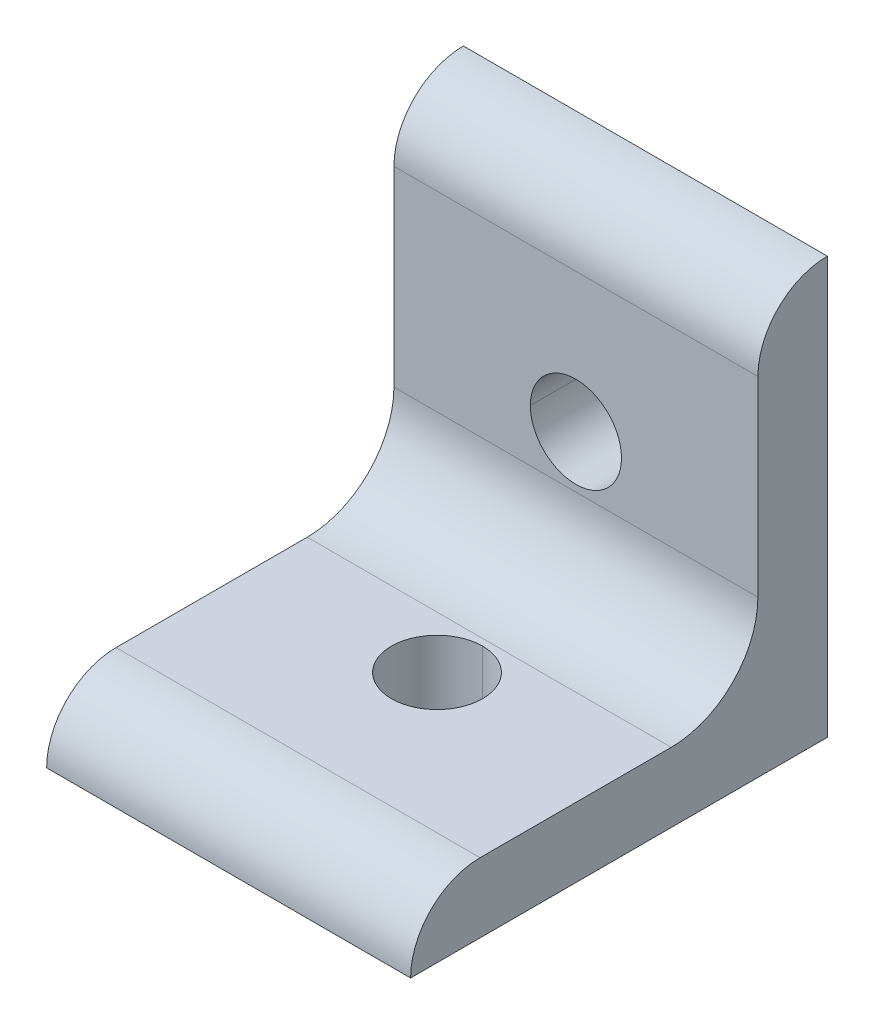
ISO-10303-21;
HEADER;
FILE_DESCRIPTION(('STEP AP214'),'2;1');
FILE_NAME('part.step','',(''),(''),'','','');
FILE_SCHEMA(('AUTOMOTIVE_DESIGN { 1 0 10303 214 1 1 1 1 }'));
ENDSEC;
DATA;
#1=APPLICATION_CONTEXT('core data for automotive mechanical design processes');
#2=APPLICATION_PROTOCOL_DEFINITION('international standard','automotive_design',2000,#1);
#3=PRODUCT_CONTEXT('',#1,'mechanical');
#4=PRODUCT('Part','Part','',(#3));
#5=PRODUCT_RELATED_PRODUCT_CATEGORY('part','',(#4));
#6=PRODUCT_DEFINITION_FORMATION('','',#4);
#7=PRODUCT_DEFINITION_CONTEXT('part definition',#1,'design');
#8=PRODUCT_DEFINITION('design','',#6,#7);
#9=PRODUCT_DEFINITION_SHAPE('','',#8);
#10=(LENGTH_UNIT() NAMED_UNIT(*) SI_UNIT(.MILLI.,.METRE.));
#11=(NAMED_UNIT(*) PLANE_ANGLE_UNIT() SI_UNIT($,.RADIAN.));
#12=(NAMED_UNIT(*) SI_UNIT($,.STERADIAN.) SOLID_ANGLE_UNIT());
#13=UNCERTAINTY_MEASURE_WITH_UNIT(LENGTH_MEASURE(1.E-05),#10,'distance_accuracy_value','');
#14=(GEOMETRIC_REPRESENTATION_CONTEXT(3) GLOBAL_UNCERTAINTY_ASSIGNED_CONTEXT((#13)) GLOBAL_UNIT_ASSIGNED_CONTEXT((#10,
#11,#12)) REPRESENTATION_CONTEXT('',''));
#15=CARTESIAN_POINT('',(0.,0.,0.));
#16=DIRECTION('',(0.,0.,1.));
#17=DIRECTION('',(1.,0.,0.));
#18=AXIS2_PLACEMENT_3D('',#15,#16,#17);
#19=CARTESIAN_POINT('',(16.637,-1.46063716677247E-12,31.7499999999986));
#20=DIRECTION('',(-1.,0.,0.));
#21=DIRECTION('',(0.,-0.707106781186548,-0.707106781186547));
#22=AXIS2_PLACEMENT_3D('',#19,#20,#21);
#23=CYLINDRICAL_SURFACE('',#22,6.35000000000146);
#24=CARTESIAN_POINT('',(-16.637,-1.46063716677247E-12,31.7499999999986));
#25=DIRECTION('',(1.,0.,0.));
#26=DIRECTION('',(0.,0.,-1.));
#27=AXIS2_PLACEMENT_3D('',#24,#25,#26);
#28=CIRCLE('',#27,6.35000000000146);
#29=CARTESIAN_POINT('',(-16.637,6.35,31.75));
#30=VERTEX_POINT('',#29);
#31=CARTESIAN_POINT('',(-16.637,0.,38.1));
#32=VERTEX_POINT('',#31);
#33=EDGE_CURVE('E11',#30,#32,#28,.T.);
#34=ORIENTED_EDGE('',*,*,#33,.T.);
#35=DIRECTION('',(-1.,0.,0.));
#36=VECTOR('',#35,1.);
#37=CARTESIAN_POINT('',(16.637,0.,38.1));
#38=LINE('',#37,#36);
#39=CARTESIAN_POINT('',(16.637,0.,38.1));
#40=VERTEX_POINT('',#39);
#41=EDGE_CURVE('E25',#40,#32,#38,.T.);
#42=ORIENTED_EDGE('',*,*,#41,.F.);
#43=CARTESIAN_POINT('',(16.637,-1.46063716677247E-12,31.7499999999986));
#44=DIRECTION('',(1.,0.,0.));
#45=DIRECTION('',(0.,0.,-1.));
#46=AXIS2_PLACEMENT_3D('',#43,#44,#45);
#47=CIRCLE('',#46,6.35000000000146);
#48=CARTESIAN_POINT('',(16.637,6.35,31.75));
#49=VERTEX_POINT('',#48);
#50=EDGE_CURVE('E238',#49,#40,#47,.T.);
#51=ORIENTED_EDGE('',*,*,#50,.F.);
#52=DIRECTION('',(-1.,0.,0.));
#53=VECTOR('',#52,1.);
#54=CARTESIAN_POINT('',(16.637,6.35,31.75));
#55=LINE('',#54,#53);
#56=EDGE_CURVE('E234',#49,#30,#55,.T.);
#57=ORIENTED_EDGE('',*,*,#56,.T.);
#58=EDGE_LOOP('',(#34,#42,#51,#57));
#59=FACE_BOUND('',#58,.T.);
#60=ADVANCED_FACE('F17',(#59),#23,.T.);
#61=CARTESIAN_POINT('',(16.637,6.35,14.2748));
#62=DIRECTION('',(0.,-1.,0.));
#63=DIRECTION('',(0.,0.,-1.));
#64=AXIS2_PLACEMENT_3D('',#61,#62,#63);
#65=PLANE('',#64);
#66=CARTESIAN_POINT('',(0.,6.35,19.05));
#67=DIRECTION('',(0.,1.,0.));
#68=DIRECTION('',(1.,0.,0.));
#69=AXIS2_PLACEMENT_3D('',#66,#67,#68);
#70=CIRCLE('',#69,4.1656);
#71=CARTESIAN_POINT('',(0.,6.35,14.8844));
#72=VERTEX_POINT('',#71);
#73=CARTESIAN_POINT('',(0.,6.35,23.2156));
#74=VERTEX_POINT('',#73);
#75=EDGE_CURVE('E230',#72,#74,#70,.T.);
#76=ORIENTED_EDGE('',*,*,#75,.F.);
#77=CARTESIAN_POINT('',(0.,6.35,19.05));
#78=DIRECTION('',(0.,1.,0.));
#79=DIRECTION('',(0.,0.,1.));
#80=AXIS2_PLACEMENT_3D('',#77,#78,#79);
#81=CIRCLE('',#80,4.1656);
#82=EDGE_CURVE('E116',#74,#72,#81,.T.);
#83=ORIENTED_EDGE('',*,*,#82,.F.);
#84=EDGE_LOOP('',(#76,#83));
#85=FACE_BOUND('',#84,.T.);
#86=DIRECTION('',(0.,0.,1.));
#87=VECTOR('',#86,1.);
#88=CARTESIAN_POINT('',(-16.637,6.35,14.2748));
#89=LINE('',#88,#87);
#90=CARTESIAN_POINT('',(-16.637,6.35,14.2748));
#91=VERTEX_POINT('',#90);
#92=EDGE_CURVE('E222',#91,#30,#89,.T.);
#93=ORIENTED_EDGE('',*,*,#92,.T.);
#94=ORIENTED_EDGE('',*,*,#56,.F.);
#95=DIRECTION('',(0.,0.,1.));
#96=VECTOR('',#95,1.);
#97=CARTESIAN_POINT('',(16.637,6.35,14.2748));
#98=LINE('',#97,#96);
#99=CARTESIAN_POINT('',(16.637,6.35,14.2748));
#100=VERTEX_POINT('',#99);
#101=EDGE_CURVE('E217',#100,#49,#98,.T.);
#102=ORIENTED_EDGE('',*,*,#101,.F.);
#103=DIRECTION('',(-1.,0.,0.));
#104=VECTOR('',#103,1.);
#105=CARTESIAN_POINT('',(16.637,6.35,14.2748));
#106=LINE('',#105,#104);
#107=EDGE_CURVE('E213',#100,#91,#106,.T.);
#108=ORIENTED_EDGE('',*,*,#107,.T.);
#109=EDGE_LOOP('',(#93,#94,#102,#108));
#110=FACE_BOUND('',#109,.T.);
#111=ADVANCED_FACE('F255',(#85,#110),#65,.F.);
#112=CARTESIAN_POINT('',(16.637,14.2748000000002,14.2748000000002));
#113=DIRECTION('',(-1.,0.,0.));
#114=DIRECTION('',(0.,0.707106781186537,0.707106781186558));
#115=AXIS2_PLACEMENT_3D('',#112,#113,#114);
#116=CYLINDRICAL_SURFACE('',#115,7.92480000000024);
#117=CARTESIAN_POINT('',(-16.637,14.2748000000002,14.2748000000002));
#118=DIRECTION('',(1.,0.,0.));
#119=DIRECTION('',(0.,0.,-1.));
#120=AXIS2_PLACEMENT_3D('',#117,#118,#119);
#121=CIRCLE('',#120,7.92480000000024);
#122=CARTESIAN_POINT('',(-16.637,14.2748,6.35));
#123=VERTEX_POINT('',#122);
#124=EDGE_CURVE('E208',#91,#123,#121,.T.);
#125=ORIENTED_EDGE('',*,*,#124,.F.);
#126=ORIENTED_EDGE('',*,*,#107,.F.);
#127=CARTESIAN_POINT('',(16.637,14.2748000000002,14.2748000000002));
#128=DIRECTION('',(1.,0.,0.));
#129=DIRECTION('',(0.,0.,-1.));
#130=AXIS2_PLACEMENT_3D('',#127,#128,#129);
#131=CIRCLE('',#130,7.92480000000024);
#132=CARTESIAN_POINT('',(16.637,14.2748,6.35));
#133=VERTEX_POINT('',#132);
#134=EDGE_CURVE('E204',#100,#133,#131,.T.);
#135=ORIENTED_EDGE('',*,*,#134,.T.);
#136=DIRECTION('',(-1.,0.,0.));
#137=VECTOR('',#136,1.);
#138=CARTESIAN_POINT('',(16.637,14.2748,6.35));
#139=LINE('',#138,#137);
#140=EDGE_CURVE('E200',#133,#123,#139,.T.);
#141=ORIENTED_EDGE('',*,*,#140,.T.);
#142=EDGE_LOOP('',(#125,#126,#135,#141));
#143=FACE_BOUND('',#142,.T.);
#144=ADVANCED_FACE('F272',(#143),#116,.F.);
#145=CARTESIAN_POINT('',(16.637,31.75,6.35));
#146=DIRECTION('',(0.,0.,-1.));
#147=DIRECTION('',(-1.,0.,0.));
#148=AXIS2_PLACEMENT_3D('',#145,#146,#147);
#149=PLANE('',#148);
#150=CARTESIAN_POINT('',(0.,19.05,6.35));
#151=DIRECTION('',(0.,0.,1.));
#152=DIRECTION('',(1.,0.,0.));
#153=AXIS2_PLACEMENT_3D('',#150,#151,#152);
#154=CIRCLE('',#153,4.1656);
#155=CARTESIAN_POINT('',(-4.1656,19.05,6.35));
#156=VERTEX_POINT('',#155);
#157=CARTESIAN_POINT('',(4.1656,19.05,6.35));
#158=VERTEX_POINT('',#157);
#159=EDGE_CURVE('E195',#156,#158,#154,.T.);
#160=ORIENTED_EDGE('',*,*,#159,.F.);
#161=CARTESIAN_POINT('',(0.,19.05,6.35));
#162=DIRECTION('',(0.,0.,1.));
#163=DIRECTION('',(1.,0.,0.));
#164=AXIS2_PLACEMENT_3D('',#161,#162,#163);
#165=CIRCLE('',#164,4.1656);
#166=EDGE_CURVE('E190',#158,#156,#165,.T.);
#167=ORIENTED_EDGE('',*,*,#166,.F.);
#168=EDGE_LOOP('',(#160,#167));
#169=FACE_BOUND('',#168,.T.);
#170=DIRECTION('',(0.,-1.,0.));
#171=VECTOR('',#170,1.);
#172=CARTESIAN_POINT('',(-16.637,31.75,6.35));
#173=LINE('',#172,#171);
#174=CARTESIAN_POINT('',(-16.637,31.75,6.35));
#175=VERTEX_POINT('',#174);
#176=EDGE_CURVE('E185',#175,#123,#173,.T.);
#177=ORIENTED_EDGE('',*,*,#176,.T.);
#178=ORIENTED_EDGE('',*,*,#140,.F.);
#179=DIRECTION('',(0.,-1.,0.));
#180=VECTOR('',#179,1.);
#181=CARTESIAN_POINT('',(16.637,31.75,6.35));
#182=LINE('',#181,#180);
#183=CARTESIAN_POINT('',(16.637,31.75,6.35));
#184=VERTEX_POINT('',#183);
#185=EDGE_CURVE('E180',#184,#133,#182,.T.);
#186=ORIENTED_EDGE('',*,*,#185,.F.);
#187=DIRECTION('',(-1.,0.,0.));
#188=VECTOR('',#187,1.);
#189=CARTESIAN_POINT('',(16.637,31.75,6.35));
#190=LINE('',#189,#188);
#191=EDGE_CURVE('E176',#184,#175,#190,.T.);
#192=ORIENTED_EDGE('',*,*,#191,.T.);
#193=EDGE_LOOP('',(#177,#178,#186,#192));
#194=FACE_BOUND('',#193,.T.);
#195=ADVANCED_FACE('F270',(#169,#194),#149,.F.);
#196=CARTESIAN_POINT('',(16.637,31.7499999999986,-1.46020348590348E-12));
#197=DIRECTION('',(-1.,0.,0.));
#198=DIRECTION('',(0.,-0.707106781186547,-0.707106781186548));
#199=AXIS2_PLACEMENT_3D('',#196,#197,#198);
#200=CYLINDRICAL_SURFACE('',#199,6.35000000000146);
#201=CARTESIAN_POINT('',(-16.637,31.7499999999986,-1.46020348590348E-12));
#202=DIRECTION('',(1.,0.,0.));
#203=DIRECTION('',(0.,0.,-1.));
#204=AXIS2_PLACEMENT_3D('',#201,#202,#203);
#205=CIRCLE('',#204,6.35000000000146);
#206=CARTESIAN_POINT('',(-16.637,38.1,0.));
#207=VERTEX_POINT('',#206);
#208=EDGE_CURVE('E171',#207,#175,#205,.T.);
#209=ORIENTED_EDGE('',*,*,#208,.T.);
#210=ORIENTED_EDGE('',*,*,#191,.F.);
#211=CARTESIAN_POINT('',(16.637,31.7499999999986,-1.46020348590348E-12));
#212=DIRECTION('',(1.,0.,0.));
#213=DIRECTION('',(0.,0.,-1.));
#214=AXIS2_PLACEMENT_3D('',#211,#212,#213);
#215=CIRCLE('',#214,6.35000000000146);
#216=CARTESIAN_POINT('',(16.637,38.1,0.));
#217=VERTEX_POINT('',#216);
#218=EDGE_CURVE('E166',#217,#184,#215,.T.);
#219=ORIENTED_EDGE('',*,*,#218,.F.);
#220=DIRECTION('',(-1.,0.,0.));
#221=VECTOR('',#220,1.);
#222=CARTESIAN_POINT('',(16.637,38.1,0.));
#223=LINE('',#222,#221);
#224=EDGE_CURVE('E162',#217,#207,#223,.T.);
#225=ORIENTED_EDGE('',*,*,#224,.T.);
#226=EDGE_LOOP('',(#209,#210,#219,#225));
#227=FACE_BOUND('',#226,.T.);
#228=ADVANCED_FACE('F268',(#227),#200,.T.);
#229=CARTESIAN_POINT('',(16.637,0.,0.));
#230=DIRECTION('',(0.,0.,1.));
#231=DIRECTION('',(1.,0.,0.));
#232=AXIS2_PLACEMENT_3D('',#229,#230,#231);
#233=PLANE('',#232);
#234=CARTESIAN_POINT('',(0.,19.05,0.));
#235=DIRECTION('',(0.,0.,1.));
#236=DIRECTION('',(1.,0.,0.));
#237=AXIS2_PLACEMENT_3D('',#234,#235,#236);
#238=CIRCLE('',#237,4.1656);
#239=CARTESIAN_POINT('',(4.1656,19.05,0.));
#240=VERTEX_POINT('',#239);
#241=CARTESIAN_POINT('',(-4.1656,19.05,0.));
#242=VERTEX_POINT('',#241);
#243=EDGE_CURVE('E158',#240,#242,#238,.T.);
#244=ORIENTED_EDGE('',*,*,#243,.T.);
#245=CARTESIAN_POINT('',(0.,19.05,0.));
#246=DIRECTION('',(0.,0.,1.));
#247=DIRECTION('',(1.,0.,0.));
#248=AXIS2_PLACEMENT_3D('',#245,#246,#247);
#249=CIRCLE('',#248,4.1656);
#250=EDGE_CURVE('E154',#242,#240,#249,.T.);
#251=ORIENTED_EDGE('',*,*,#250,.T.);
#252=EDGE_LOOP('',(#244,#251));
#253=FACE_BOUND('',#252,.T.);
#254=DIRECTION('',(0.,1.,0.));
#255=VECTOR('',#254,1.);
#256=CARTESIAN_POINT('',(-16.637,0.,0.));
#257=LINE('',#256,#255);
#258=CARTESIAN_POINT('',(-16.637,0.,0.));
#259=VERTEX_POINT('',#258);
#260=EDGE_CURVE('E149',#259,#207,#257,.T.);
#261=ORIENTED_EDGE('',*,*,#260,.T.);
#262=ORIENTED_EDGE('',*,*,#224,.F.);
#263=DIRECTION('',(0.,1.,0.));
#264=VECTOR('',#263,1.);
#265=CARTESIAN_POINT('',(16.637,0.,0.));
#266=LINE('',#265,#264);
#267=CARTESIAN_POINT('',(16.637,0.,0.));
#268=VERTEX_POINT('',#267);
#269=EDGE_CURVE('E144',#268,#217,#266,.T.);
#270=ORIENTED_EDGE('',*,*,#269,.F.);
#271=DIRECTION('',(-1.,0.,0.));
#272=VECTOR('',#271,1.);
#273=CARTESIAN_POINT('',(16.637,0.,0.));
#274=LINE('',#273,#272);
#275=EDGE_CURVE('E113',#268,#259,#274,.T.);
#276=ORIENTED_EDGE('',*,*,#275,.T.);
#277=EDGE_LOOP('',(#261,#262,#270,#276));
#278=FACE_BOUND('',#277,.T.);
#279=ADVANCED_FACE('F264',(#253,#278),#233,.F.);
#280=CARTESIAN_POINT('',(16.637,0.,38.1));
#281=DIRECTION('',(0.,1.,0.));
#282=DIRECTION('',(0.,0.,1.));
#283=AXIS2_PLACEMENT_3D('',#280,#281,#282);
#284=PLANE('',#283);
#285=CARTESIAN_POINT('',(0.,0.,19.05));
#286=DIRECTION('',(0.,1.,0.));
#287=DIRECTION('',(1.,0.,0.));
#288=AXIS2_PLACEMENT_3D('',#285,#286,#287);
#289=CIRCLE('',#288,4.1656);
#290=CARTESIAN_POINT('',(0.,0.,14.8844));
#291=VERTEX_POINT('',#290);
#292=CARTESIAN_POINT('',(0.,0.,23.2156));
#293=VERTEX_POINT('',#292);
#294=EDGE_CURVE('E99',#291,#293,#289,.T.);
#295=ORIENTED_EDGE('',*,*,#294,.T.);
#296=CARTESIAN_POINT('',(0.,0.,19.05));
#297=DIRECTION('',(0.,1.,0.));
#298=DIRECTION('',(0.,0.,1.));
#299=AXIS2_PLACEMENT_3D('',#296,#297,#298);
#300=CIRCLE('',#299,4.1656);
#301=EDGE_CURVE('E95',#293,#291,#300,.T.);
#302=ORIENTED_EDGE('',*,*,#301,.T.);
#303=EDGE_LOOP('',(#295,#302));
#304=FACE_BOUND('',#303,.T.);
#305=DIRECTION('',(0.,0.,-1.));
#306=VECTOR('',#305,1.);
#307=CARTESIAN_POINT('',(-16.637,0.,38.1));
#308=LINE('',#307,#306);
#309=EDGE_CURVE('E104',#32,#259,#308,.T.);
#310=ORIENTED_EDGE('',*,*,#309,.T.);
#311=ORIENTED_EDGE('',*,*,#275,.F.);
#312=DIRECTION('',(0.,0.,-1.));
#313=VECTOR('',#312,1.);
#314=CARTESIAN_POINT('',(16.637,0.,38.1));
#315=LINE('',#314,#313);
#316=EDGE_CURVE('E119',#40,#268,#315,.T.);
#317=ORIENTED_EDGE('',*,*,#316,.F.);
#318=ORIENTED_EDGE('',*,*,#41,.T.);
#319=EDGE_LOOP('',(#310,#311,#317,#318));
#320=FACE_BOUND('',#319,.T.);
#321=ADVANCED_FACE('F97',(#304,#320),#284,.F.);
#322=CARTESIAN_POINT('',(16.637,-1.46063716677247E-12,31.7499999999986));
#323=DIRECTION('',(1.,0.,0.));
#324=DIRECTION('',(0.,0.,-1.));
#325=AXIS2_PLACEMENT_3D('',#322,#323,#324);
#326=PLANE('',#325);
#327=ORIENTED_EDGE('',*,*,#50,.T.);
#328=ORIENTED_EDGE('',*,*,#316,.T.);
#329=ORIENTED_EDGE('',*,*,#269,.T.);
#330=ORIENTED_EDGE('',*,*,#218,.T.);
#331=ORIENTED_EDGE('',*,*,#185,.T.);
#332=ORIENTED_EDGE('',*,*,#134,.F.);
#333=ORIENTED_EDGE('',*,*,#101,.T.);
#334=EDGE_LOOP('',(#327,#328,#329,#330,#331,#332,#333));
#335=FACE_BOUND('',#334,.T.);
#336=ADVANCED_FACE('F250',(#335),#326,.T.);
#337=CARTESIAN_POINT('',(-16.637,-1.46063716677247E-12,31.7499999999986));
#338=DIRECTION('',(1.,0.,0.));
#339=DIRECTION('',(0.,0.,-1.));
#340=AXIS2_PLACEMENT_3D('',#337,#338,#339);
#341=PLANE('',#340);
#342=ORIENTED_EDGE('',*,*,#33,.F.);
#343=ORIENTED_EDGE('',*,*,#92,.F.);
#344=ORIENTED_EDGE('',*,*,#124,.T.);
#345=ORIENTED_EDGE('',*,*,#176,.F.);
#346=ORIENTED_EDGE('',*,*,#208,.F.);
#347=ORIENTED_EDGE('',*,*,#260,.F.);
#348=ORIENTED_EDGE('',*,*,#309,.F.);
#349=EDGE_LOOP('',(#342,#343,#344,#345,#346,#347,#348));
#350=FACE_BOUND('',#349,.T.);
#351=ADVANCED_FACE('F259',(#350),#341,.F.);
#352=CARTESIAN_POINT('',(0.,6.35,19.05));
#353=DIRECTION('',(0.,-1.,0.));
#354=DIRECTION('',(-1.,0.,0.));
#355=AXIS2_PLACEMENT_3D('',#352,#353,#354);
#356=CYLINDRICAL_SURFACE('',#355,4.1656);
#357=DIRECTION('',(0.,-1.,0.));
#358=VECTOR('',#357,1.);
#359=CARTESIAN_POINT('',(0.,6.35,23.2156));
#360=LINE('',#359,#358);
#361=EDGE_CURVE('E112',#74,#293,#360,.T.);
#362=ORIENTED_EDGE('',*,*,#361,.F.);
#363=ORIENTED_EDGE('',*,*,#82,.T.);
#364=DIRECTION('',(0.,-1.,0.));
#365=VECTOR('',#364,1.);
#366=CARTESIAN_POINT('',(0.,6.35,14.8844));
#367=LINE('',#366,#365);
#368=EDGE_CURVE('E110',#72,#291,#367,.T.);
#369=ORIENTED_EDGE('',*,*,#368,.T.);
#370=ORIENTED_EDGE('',*,*,#301,.F.);
#371=EDGE_LOOP('',(#362,#363,#369,#370));
#372=FACE_BOUND('',#371,.T.);
#373=ADVANCED_FACE('F115',(#372),#356,.F.);
#374=CARTESIAN_POINT('',(0.,6.35,19.05));
#375=DIRECTION('',(0.,-1.,0.));
#376=DIRECTION('',(1.,0.,0.));
#377=AXIS2_PLACEMENT_3D('',#374,#375,#376);
#378=CYLINDRICAL_SURFACE('',#377,4.1656);
#379=ORIENTED_EDGE('',*,*,#361,.T.);
#380=ORIENTED_EDGE('',*,*,#294,.F.);
#381=ORIENTED_EDGE('',*,*,#368,.F.);
#382=ORIENTED_EDGE('',*,*,#75,.T.);
#383=EDGE_LOOP('',(#379,#380,#381,#382));
#384=FACE_BOUND('',#383,.T.);
#385=ADVANCED_FACE('F108',(#384),#378,.F.);
#386=CARTESIAN_POINT('',(0.,19.05,6.35));
#387=DIRECTION('',(0.,0.,-1.));
#388=DIRECTION('',(0.,1.,0.));
#389=AXIS2_PLACEMENT_3D('',#386,#387,#388);
#390=CYLINDRICAL_SURFACE('',#389,4.1656);
#391=DIRECTION('',(0.,0.,-1.));
#392=VECTOR('',#391,1.);
#393=CARTESIAN_POINT('',(4.1656,19.05,6.35));
#394=LINE('',#393,#392);
#395=EDGE_CURVE('E117',#158,#240,#394,.T.);
#396=ORIENTED_EDGE('',*,*,#395,.T.);
#397=ORIENTED_EDGE('',*,*,#250,.F.);
#398=DIRECTION('',(0.,0.,-1.));
#399=VECTOR('',#398,1.);
#400=CARTESIAN_POINT('',(-4.1656,19.05,6.35));
#401=LINE('',#400,#399);
#402=EDGE_CURVE('E122',#156,#242,#401,.T.);
#403=ORIENTED_EDGE('',*,*,#402,.F.);
#404=ORIENTED_EDGE('',*,*,#159,.T.);
#405=EDGE_LOOP('',(#396,#397,#403,#404));
#406=FACE_BOUND('',#405,.T.);
#407=ADVANCED_FACE('F372',(#406),#390,.F.);
#408=CARTESIAN_POINT('',(0.,19.05,6.35));
#409=DIRECTION('',(0.,0.,-1.));
#410=DIRECTION('',(0.,-1.,0.));
#411=AXIS2_PLACEMENT_3D('',#408,#409,#410);
#412=CYLINDRICAL_SURFACE('',#411,4.1656);
#413=ORIENTED_EDGE('',*,*,#395,.F.);
#414=ORIENTED_EDGE('',*,*,#166,.T.);
#415=ORIENTED_EDGE('',*,*,#402,.T.);
#416=ORIENTED_EDGE('',*,*,#243,.F.);
#417=EDGE_LOOP('',(#413,#414,#415,#416));
#418=FACE_BOUND('',#417,.T.);
#419=ADVANCED_FACE('F382',(#418),#412,.F.);
#420=CLOSED_SHELL('',(#60,#111,#144,#195,#228,#279,#321,#336,#351,#373,#385,#407,#419));
#421=MANIFOLD_SOLID_BREP('B1',#420);
#422=ADVANCED_BREP_SHAPE_REPRESENTATION('',(#18,#421),#14);
#423=SHAPE_DEFINITION_REPRESENTATION(#9,#422);
ENDSEC;
END-ISO-10303-21;
